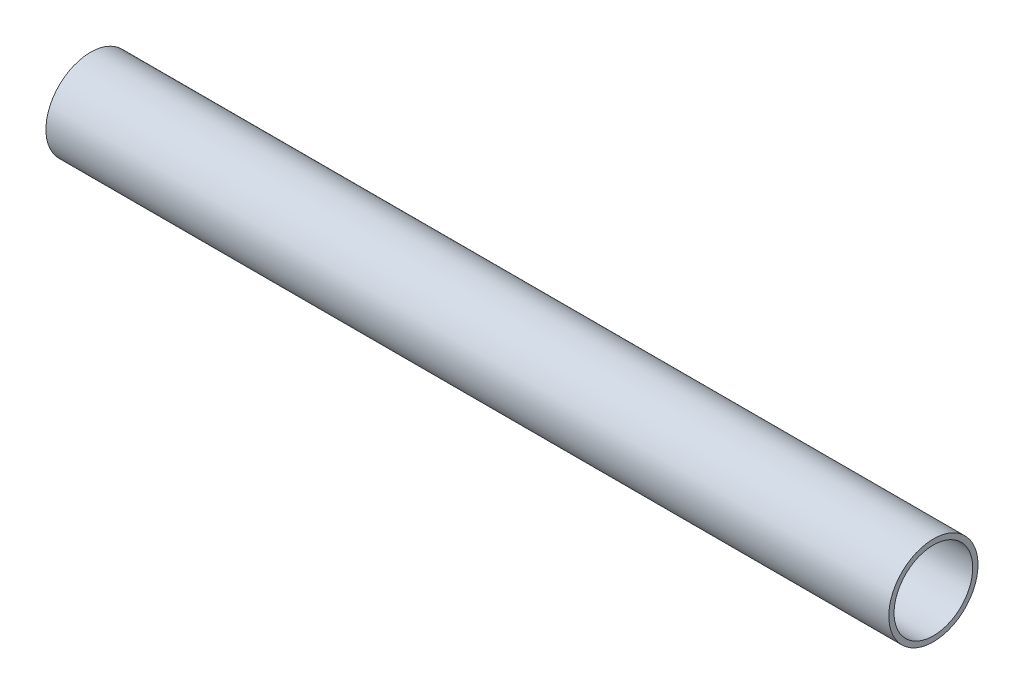
ISO-10303-21;
HEADER;
FILE_DESCRIPTION(('STEP AP214'),'2;1');
FILE_NAME('part.step','',(''),(''),'','','');
FILE_SCHEMA(('AUTOMOTIVE_DESIGN { 1 0 10303 214 1 1 1 1 }'));
ENDSEC;
DATA;
#1=APPLICATION_CONTEXT('core data for automotive mechanical design processes');
#2=APPLICATION_PROTOCOL_DEFINITION('international standard','automotive_design',2000,#1);
#3=PRODUCT_CONTEXT('',#1,'mechanical');
#4=PRODUCT('Part','Part','',(#3));
#5=PRODUCT_RELATED_PRODUCT_CATEGORY('part','',(#4));
#6=PRODUCT_DEFINITION_FORMATION('','',#4);
#7=PRODUCT_DEFINITION_CONTEXT('part definition',#1,'design');
#8=PRODUCT_DEFINITION('design','',#6,#7);
#9=PRODUCT_DEFINITION_SHAPE('','',#8);
#10=(LENGTH_UNIT() NAMED_UNIT(*) SI_UNIT(.MILLI.,.METRE.));
#11=(NAMED_UNIT(*) PLANE_ANGLE_UNIT() SI_UNIT($,.RADIAN.));
#12=(NAMED_UNIT(*) SI_UNIT($,.STERADIAN.) SOLID_ANGLE_UNIT());
#13=UNCERTAINTY_MEASURE_WITH_UNIT(LENGTH_MEASURE(1.E-05),#10,'distance_accuracy_value','');
#14=(GEOMETRIC_REPRESENTATION_CONTEXT(3) GLOBAL_UNCERTAINTY_ASSIGNED_CONTEXT((#13)) GLOBAL_UNIT_ASSIGNED_CONTEXT((#10,
#11,#12)) REPRESENTATION_CONTEXT('',''));
#15=CARTESIAN_POINT('',(0.,0.,0.));
#16=DIRECTION('',(0.,0.,1.));
#17=DIRECTION('',(1.,0.,0.));
#18=AXIS2_PLACEMENT_3D('',#15,#16,#17);
#19=CARTESIAN_POINT('',(30.,0.,0.));
#20=DIRECTION('',(1.,0.,0.));
#21=DIRECTION('',(0.,0.,-1.));
#22=AXIS2_PLACEMENT_3D('',#19,#20,#21);
#23=PLANE('',#22);
#24=CARTESIAN_POINT('',(30.,0.,0.));
#25=DIRECTION('',(1.,0.,0.));
#26=DIRECTION('',(0.,0.,-1.));
#27=AXIS2_PLACEMENT_3D('',#24,#25,#26);
#28=CIRCLE('',#27,1.5875);
#29=CARTESIAN_POINT('',(30.,0.,-1.5875));
#30=VERTEX_POINT('',#29);
#31=EDGE_CURVE('E10',#30,#30,#28,.T.);
#32=ORIENTED_EDGE('',*,*,#31,.T.);
#33=EDGE_LOOP('',(#32));
#34=FACE_BOUND('',#33,.T.);
#35=CARTESIAN_POINT('',(30.,0.,0.));
#36=DIRECTION('',(1.,0.,0.));
#37=DIRECTION('',(0.,0.,-1.));
#38=AXIS2_PLACEMENT_3D('',#35,#36,#37);
#39=CIRCLE('',#38,1.4);
#40=CARTESIAN_POINT('',(30.,0.,-1.4));
#41=VERTEX_POINT('',#40);
#42=EDGE_CURVE('E50',#41,#41,#39,.T.);
#43=ORIENTED_EDGE('',*,*,#42,.F.);
#44=EDGE_LOOP('',(#43));
#45=FACE_BOUND('',#44,.T.);
#46=ADVANCED_FACE('F37',(#34,#45),#23,.T.);
#47=CARTESIAN_POINT('',(0.,0.,0.));
#48=DIRECTION('',(1.,0.,0.));
#49=DIRECTION('',(0.,0.,-1.));
#50=AXIS2_PLACEMENT_3D('',#47,#48,#49);
#51=PLANE('',#50);
#52=CARTESIAN_POINT('',(0.,0.,0.));
#53=DIRECTION('',(1.,0.,0.));
#54=DIRECTION('',(0.,0.,-1.));
#55=AXIS2_PLACEMENT_3D('',#52,#53,#54);
#56=CIRCLE('',#55,1.5875);
#57=CARTESIAN_POINT('',(0.,0.,-1.5875));
#58=VERTEX_POINT('',#57);
#59=EDGE_CURVE('E41',#58,#58,#56,.T.);
#60=ORIENTED_EDGE('',*,*,#59,.F.);
#61=EDGE_LOOP('',(#60));
#62=FACE_BOUND('',#61,.T.);
#63=CARTESIAN_POINT('',(0.,0.,0.));
#64=DIRECTION('',(1.,0.,0.));
#65=DIRECTION('',(0.,0.,-1.));
#66=AXIS2_PLACEMENT_3D('',#63,#64,#65);
#67=CIRCLE('',#66,1.4);
#68=CARTESIAN_POINT('',(0.,0.,-1.4));
#69=VERTEX_POINT('',#68);
#70=EDGE_CURVE('E52',#69,#69,#67,.T.);
#71=ORIENTED_EDGE('',*,*,#70,.T.);
#72=EDGE_LOOP('',(#71));
#73=FACE_BOUND('',#72,.T.);
#74=ADVANCED_FACE('F64',(#62,#73),#51,.F.);
#75=CARTESIAN_POINT('',(30.,0.,0.));
#76=DIRECTION('',(-1.,0.,0.));
#77=DIRECTION('',(0.,0.,1.));
#78=AXIS2_PLACEMENT_3D('',#75,#76,#77);
#79=CYLINDRICAL_SURFACE('',#78,1.5875);
#80=ORIENTED_EDGE('',*,*,#31,.F.);
#81=EDGE_LOOP('',(#80));
#82=FACE_BOUND('',#81,.T.);
#83=ORIENTED_EDGE('',*,*,#59,.T.);
#84=EDGE_LOOP('',(#83));
#85=FACE_BOUND('',#84,.T.);
#86=ADVANCED_FACE('F39',(#82,#85),#79,.T.);
#87=CARTESIAN_POINT('',(30.,0.,0.));
#88=DIRECTION('',(-1.,0.,0.));
#89=DIRECTION('',(0.,0.,1.));
#90=AXIS2_PLACEMENT_3D('',#87,#88,#89);
#91=CYLINDRICAL_SURFACE('',#90,1.4);
#92=ORIENTED_EDGE('',*,*,#42,.T.);
#93=EDGE_LOOP('',(#92));
#94=FACE_BOUND('',#93,.T.);
#95=ORIENTED_EDGE('',*,*,#70,.F.);
#96=EDGE_LOOP('',(#95));
#97=FACE_BOUND('',#96,.T.);
#98=ADVANCED_FACE('F60',(#94,#97),#91,.F.);
#99=CLOSED_SHELL('',(#46,#74,#86,#98));
#100=MANIFOLD_SOLID_BREP('B2',#99);
#101=ADVANCED_BREP_SHAPE_REPRESENTATION('',(#18,#100),#14);
#102=SHAPE_DEFINITION_REPRESENTATION(#9,#101);
ENDSEC;
END-ISO-10303-21;
